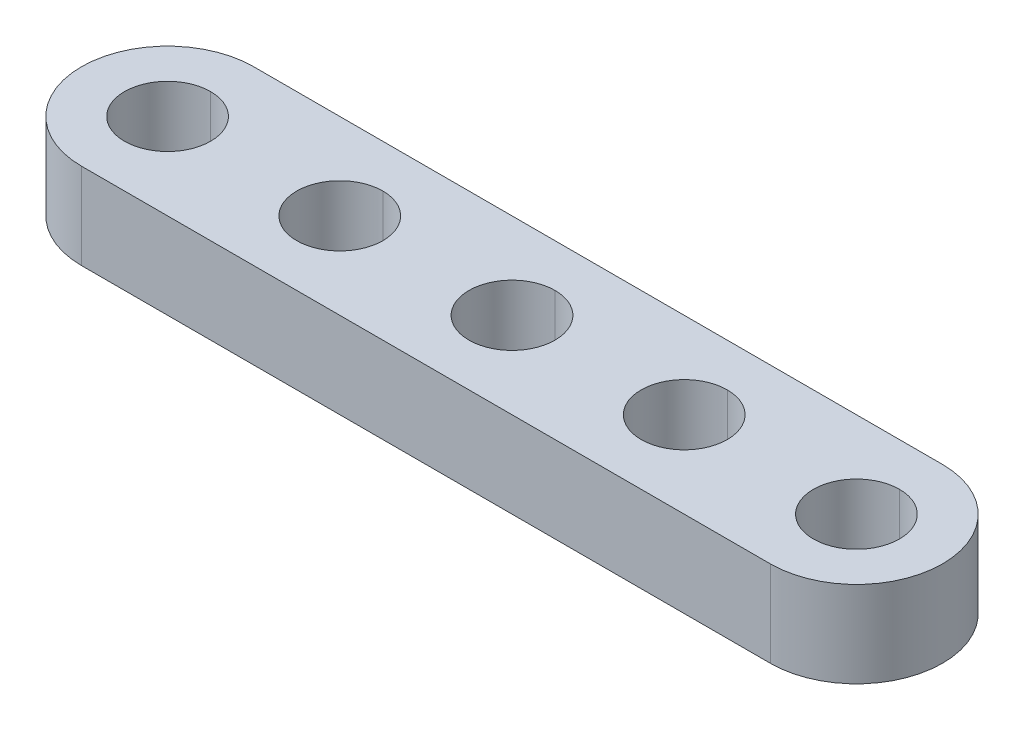
ISO-10303-21;
HEADER;
FILE_DESCRIPTION(('STEP AP214'),'2;1');
FILE_NAME('part.step','',(''),(''),'','','');
FILE_SCHEMA(('AUTOMOTIVE_DESIGN { 1 0 10303 214 1 1 1 1 }'));
ENDSEC;
DATA;
#1=APPLICATION_CONTEXT('core data for automotive mechanical design processes');
#2=APPLICATION_PROTOCOL_DEFINITION('international standard','automotive_design',2000,#1);
#3=PRODUCT_CONTEXT('',#1,'mechanical');
#4=PRODUCT('Part','Part','',(#3));
#5=PRODUCT_RELATED_PRODUCT_CATEGORY('part','',(#4));
#6=PRODUCT_DEFINITION_FORMATION('','',#4);
#7=PRODUCT_DEFINITION_CONTEXT('part definition',#1,'design');
#8=PRODUCT_DEFINITION('design','',#6,#7);
#9=PRODUCT_DEFINITION_SHAPE('','',#8);
#10=(LENGTH_UNIT() NAMED_UNIT(*) SI_UNIT(.MILLI.,.METRE.));
#11=(NAMED_UNIT(*) PLANE_ANGLE_UNIT() SI_UNIT($,.RADIAN.));
#12=(NAMED_UNIT(*) SI_UNIT($,.STERADIAN.) SOLID_ANGLE_UNIT());
#13=UNCERTAINTY_MEASURE_WITH_UNIT(LENGTH_MEASURE(1.E-05),#10,'distance_accuracy_value','');
#14=(GEOMETRIC_REPRESENTATION_CONTEXT(3) GLOBAL_UNCERTAINTY_ASSIGNED_CONTEXT((#13)) GLOBAL_UNIT_ASSIGNED_CONTEXT((#10,
#11,#12)) REPRESENTATION_CONTEXT('',''));
#15=CARTESIAN_POINT('',(0.,0.,0.));
#16=DIRECTION('',(0.,0.,1.));
#17=DIRECTION('',(1.,0.,0.));
#18=AXIS2_PLACEMENT_3D('',#15,#16,#17);
#19=CARTESIAN_POINT('',(16.,4.,0.));
#20=DIRECTION('',(0.,1.,0.));
#21=DIRECTION('',(0.,0.,1.));
#22=AXIS2_PLACEMENT_3D('',#19,#20,#21);
#23=CYLINDRICAL_SURFACE('',#22,2.);
#24=DIRECTION('',(0.,1.,0.));
#25=VECTOR('',#24,1.);
#26=CARTESIAN_POINT('',(16.,4.,-2.));
#27=LINE('',#26,#25);
#28=CARTESIAN_POINT('',(16.,0.,-2.));
#29=VERTEX_POINT('',#28);
#30=CARTESIAN_POINT('',(16.,4.,-2.));
#31=VERTEX_POINT('',#30);
#32=EDGE_CURVE('E167',#29,#31,#27,.T.);
#33=ORIENTED_EDGE('',*,*,#32,.F.);
#34=CARTESIAN_POINT('',(16.,0.,0.));
#35=DIRECTION('',(0.,1.,0.));
#36=DIRECTION('',(0.,0.,1.));
#37=AXIS2_PLACEMENT_3D('',#34,#35,#36);
#38=CIRCLE('',#37,2.);
#39=CARTESIAN_POINT('',(16.,0.,2.));
#40=VERTEX_POINT('',#39);
#41=EDGE_CURVE('E186',#40,#29,#38,.T.);
#42=ORIENTED_EDGE('',*,*,#41,.F.);
#43=DIRECTION('',(0.,1.,0.));
#44=VECTOR('',#43,1.);
#45=CARTESIAN_POINT('',(16.,4.,2.));
#46=LINE('',#45,#44);
#47=CARTESIAN_POINT('',(16.,4.,2.));
#48=VERTEX_POINT('',#47);
#49=EDGE_CURVE('E166',#40,#48,#46,.T.);
#50=ORIENTED_EDGE('',*,*,#49,.T.);
#51=CARTESIAN_POINT('',(16.,4.,0.));
#52=DIRECTION('',(0.,1.,0.));
#53=DIRECTION('',(0.,0.,1.));
#54=AXIS2_PLACEMENT_3D('',#51,#52,#53);
#55=CIRCLE('',#54,2.);
#56=EDGE_CURVE('E135',#48,#31,#55,.T.);
#57=ORIENTED_EDGE('',*,*,#56,.T.);
#58=EDGE_LOOP('',(#33,#42,#50,#57));
#59=FACE_BOUND('',#58,.T.);
#60=ADVANCED_FACE('F15',(#59),#23,.F.);
#61=CARTESIAN_POINT('',(8.,4.,0.));
#62=DIRECTION('',(0.,1.,0.));
#63=DIRECTION('',(0.,0.,1.));
#64=AXIS2_PLACEMENT_3D('',#61,#62,#63);
#65=CYLINDRICAL_SURFACE('',#64,2.);
#66=DIRECTION('',(0.,1.,0.));
#67=VECTOR('',#66,1.);
#68=CARTESIAN_POINT('',(8.,4.,-2.));
#69=LINE('',#68,#67);
#70=CARTESIAN_POINT('',(8.,0.,-2.));
#71=VERTEX_POINT('',#70);
#72=CARTESIAN_POINT('',(8.,4.,-2.));
#73=VERTEX_POINT('',#72);
#74=EDGE_CURVE('E246',#71,#73,#69,.T.);
#75=ORIENTED_EDGE('',*,*,#74,.F.);
#76=CARTESIAN_POINT('',(8.,0.,0.));
#77=DIRECTION('',(0.,1.,0.));
#78=DIRECTION('',(0.,0.,1.));
#79=AXIS2_PLACEMENT_3D('',#76,#77,#78);
#80=CIRCLE('',#79,2.);
#81=CARTESIAN_POINT('',(8.,0.,2.));
#82=VERTEX_POINT('',#81);
#83=EDGE_CURVE('E189',#82,#71,#80,.T.);
#84=ORIENTED_EDGE('',*,*,#83,.F.);
#85=DIRECTION('',(0.,1.,0.));
#86=VECTOR('',#85,1.);
#87=CARTESIAN_POINT('',(8.,4.,2.));
#88=LINE('',#87,#86);
#89=CARTESIAN_POINT('',(8.,4.,2.));
#90=VERTEX_POINT('',#89);
#91=EDGE_CURVE('E191',#82,#90,#88,.T.);
#92=ORIENTED_EDGE('',*,*,#91,.T.);
#93=CARTESIAN_POINT('',(8.,4.,0.));
#94=DIRECTION('',(0.,1.,0.));
#95=DIRECTION('',(0.,0.,1.));
#96=AXIS2_PLACEMENT_3D('',#93,#94,#95);
#97=CIRCLE('',#96,2.);
#98=EDGE_CURVE('E259',#90,#73,#97,.T.);
#99=ORIENTED_EDGE('',*,*,#98,.T.);
#100=EDGE_LOOP('',(#75,#84,#92,#99));
#101=FACE_BOUND('',#100,.T.);
#102=ADVANCED_FACE('F469',(#101),#65,.F.);
#103=CARTESIAN_POINT('',(0.,4.,0.));
#104=DIRECTION('',(0.,1.,0.));
#105=DIRECTION('',(0.,0.,1.));
#106=AXIS2_PLACEMENT_3D('',#103,#104,#105);
#107=CYLINDRICAL_SURFACE('',#106,2.);
#108=DIRECTION('',(0.,1.,0.));
#109=VECTOR('',#108,1.);
#110=CARTESIAN_POINT('',(0.,4.,-2.));
#111=LINE('',#110,#109);
#112=CARTESIAN_POINT('',(0.,0.,-2.));
#113=VERTEX_POINT('',#112);
#114=CARTESIAN_POINT('',(0.,4.,-2.));
#115=VERTEX_POINT('',#114);
#116=EDGE_CURVE('E204',#113,#115,#111,.T.);
#117=ORIENTED_EDGE('',*,*,#116,.F.);
#118=CARTESIAN_POINT('',(0.,0.,0.));
#119=DIRECTION('',(0.,1.,0.));
#120=DIRECTION('',(0.,0.,1.));
#121=AXIS2_PLACEMENT_3D('',#118,#119,#120);
#122=CIRCLE('',#121,2.);
#123=CARTESIAN_POINT('',(0.,0.,2.));
#124=VERTEX_POINT('',#123);
#125=EDGE_CURVE('E236',#124,#113,#122,.T.);
#126=ORIENTED_EDGE('',*,*,#125,.F.);
#127=DIRECTION('',(0.,1.,0.));
#128=VECTOR('',#127,1.);
#129=CARTESIAN_POINT('',(0.,4.,2.));
#130=LINE('',#129,#128);
#131=CARTESIAN_POINT('',(0.,4.,2.));
#132=VERTEX_POINT('',#131);
#133=EDGE_CURVE('E180',#124,#132,#130,.T.);
#134=ORIENTED_EDGE('',*,*,#133,.T.);
#135=CARTESIAN_POINT('',(0.,4.,0.));
#136=DIRECTION('',(0.,1.,0.));
#137=DIRECTION('',(0.,0.,1.));
#138=AXIS2_PLACEMENT_3D('',#135,#136,#137);
#139=CIRCLE('',#138,2.);
#140=EDGE_CURVE('E199',#132,#115,#139,.T.);
#141=ORIENTED_EDGE('',*,*,#140,.T.);
#142=EDGE_LOOP('',(#117,#126,#134,#141));
#143=FACE_BOUND('',#142,.T.);
#144=ADVANCED_FACE('F383',(#143),#107,.F.);
#145=CARTESIAN_POINT('',(-8.,4.,0.));
#146=DIRECTION('',(0.,1.,0.));
#147=DIRECTION('',(0.,0.,1.));
#148=AXIS2_PLACEMENT_3D('',#145,#146,#147);
#149=CYLINDRICAL_SURFACE('',#148,2.);
#150=DIRECTION('',(0.,1.,0.));
#151=VECTOR('',#150,1.);
#152=CARTESIAN_POINT('',(-8.,4.,-2.));
#153=LINE('',#152,#151);
#154=CARTESIAN_POINT('',(-8.,0.,-2.));
#155=VERTEX_POINT('',#154);
#156=CARTESIAN_POINT('',(-8.,4.,-2.));
#157=VERTEX_POINT('',#156);
#158=EDGE_CURVE('E175',#155,#157,#153,.T.);
#159=ORIENTED_EDGE('',*,*,#158,.F.);
#160=CARTESIAN_POINT('',(-8.,0.,0.));
#161=DIRECTION('',(0.,1.,0.));
#162=DIRECTION('',(0.,0.,1.));
#163=AXIS2_PLACEMENT_3D('',#160,#161,#162);
#164=CIRCLE('',#163,2.);
#165=CARTESIAN_POINT('',(-8.,0.,2.));
#166=VERTEX_POINT('',#165);
#167=EDGE_CURVE('E25',#166,#155,#164,.T.);
#168=ORIENTED_EDGE('',*,*,#167,.F.);
#169=DIRECTION('',(0.,1.,0.));
#170=VECTOR('',#169,1.);
#171=CARTESIAN_POINT('',(-8.,4.,2.));
#172=LINE('',#171,#170);
#173=CARTESIAN_POINT('',(-8.,4.,2.));
#174=VERTEX_POINT('',#173);
#175=EDGE_CURVE('E174',#166,#174,#172,.T.);
#176=ORIENTED_EDGE('',*,*,#175,.T.);
#177=CARTESIAN_POINT('',(-8.,4.,0.));
#178=DIRECTION('',(0.,1.,0.));
#179=DIRECTION('',(0.,0.,1.));
#180=AXIS2_PLACEMENT_3D('',#177,#178,#179);
#181=CIRCLE('',#180,2.);
#182=EDGE_CURVE('E197',#174,#157,#181,.T.);
#183=ORIENTED_EDGE('',*,*,#182,.T.);
#184=EDGE_LOOP('',(#159,#168,#176,#183));
#185=FACE_BOUND('',#184,.T.);
#186=ADVANCED_FACE('F375',(#185),#149,.F.);
#187=CARTESIAN_POINT('',(-16.,4.,0.));
#188=DIRECTION('',(0.,1.,0.));
#189=DIRECTION('',(0.,0.,1.));
#190=AXIS2_PLACEMENT_3D('',#187,#188,#189);
#191=CYLINDRICAL_SURFACE('',#190,2.);
#192=DIRECTION('',(0.,1.,0.));
#193=VECTOR('',#192,1.);
#194=CARTESIAN_POINT('',(-16.,4.,-2.));
#195=LINE('',#194,#193);
#196=CARTESIAN_POINT('',(-16.,0.,-2.));
#197=VERTEX_POINT('',#196);
#198=CARTESIAN_POINT('',(-16.,4.,-2.));
#199=VERTEX_POINT('',#198);
#200=EDGE_CURVE('E209',#197,#199,#195,.T.);
#201=ORIENTED_EDGE('',*,*,#200,.F.);
#202=CARTESIAN_POINT('',(-16.,0.,0.));
#203=DIRECTION('',(0.,1.,0.));
#204=DIRECTION('',(0.,0.,1.));
#205=AXIS2_PLACEMENT_3D('',#202,#203,#204);
#206=CIRCLE('',#205,2.);
#207=CARTESIAN_POINT('',(-16.,0.,2.));
#208=VERTEX_POINT('',#207);
#209=EDGE_CURVE('E10',#208,#197,#206,.T.);
#210=ORIENTED_EDGE('',*,*,#209,.F.);
#211=DIRECTION('',(0.,1.,0.));
#212=VECTOR('',#211,1.);
#213=CARTESIAN_POINT('',(-16.,4.,2.));
#214=LINE('',#213,#212);
#215=CARTESIAN_POINT('',(-16.,4.,2.));
#216=VERTEX_POINT('',#215);
#217=EDGE_CURVE('E161',#208,#216,#214,.T.);
#218=ORIENTED_EDGE('',*,*,#217,.T.);
#219=CARTESIAN_POINT('',(-16.,4.,0.));
#220=DIRECTION('',(0.,1.,0.));
#221=DIRECTION('',(0.,0.,1.));
#222=AXIS2_PLACEMENT_3D('',#219,#220,#221);
#223=CIRCLE('',#222,2.);
#224=EDGE_CURVE('E190',#216,#199,#223,.T.);
#225=ORIENTED_EDGE('',*,*,#224,.T.);
#226=EDGE_LOOP('',(#201,#210,#218,#225));
#227=FACE_BOUND('',#226,.T.);
#228=ADVANCED_FACE('F308',(#227),#191,.F.);
#229=CARTESIAN_POINT('',(-16.,0.,0.));
#230=DIRECTION('',(0.,1.,0.));
#231=DIRECTION('',(1.,0.,0.));
#232=AXIS2_PLACEMENT_3D('',#229,#230,#231);
#233=PLANE('',#232);
#234=ORIENTED_EDGE('',*,*,#209,.T.);
#235=CARTESIAN_POINT('',(-16.,0.,0.));
#236=DIRECTION('',(0.,1.,0.));
#237=DIRECTION('',(0.,0.,1.));
#238=AXIS2_PLACEMENT_3D('',#235,#236,#237);
#239=CIRCLE('',#238,2.);
#240=EDGE_CURVE('E213',#197,#208,#239,.T.);
#241=ORIENTED_EDGE('',*,*,#240,.T.);
#242=EDGE_LOOP('',(#234,#241));
#243=FACE_BOUND('',#242,.T.);
#244=ORIENTED_EDGE('',*,*,#167,.T.);
#245=CARTESIAN_POINT('',(-8.,0.,0.));
#246=DIRECTION('',(0.,1.,0.));
#247=DIRECTION('',(0.,0.,1.));
#248=AXIS2_PLACEMENT_3D('',#245,#246,#247);
#249=CIRCLE('',#248,2.);
#250=EDGE_CURVE('E176',#155,#166,#249,.T.);
#251=ORIENTED_EDGE('',*,*,#250,.T.);
#252=EDGE_LOOP('',(#244,#251));
#253=FACE_BOUND('',#252,.T.);
#254=ORIENTED_EDGE('',*,*,#125,.T.);
#255=CARTESIAN_POINT('',(0.,0.,0.));
#256=DIRECTION('',(0.,1.,0.));
#257=DIRECTION('',(0.,0.,1.));
#258=AXIS2_PLACEMENT_3D('',#255,#256,#257);
#259=CIRCLE('',#258,2.);
#260=EDGE_CURVE('E195',#113,#124,#259,.T.);
#261=ORIENTED_EDGE('',*,*,#260,.T.);
#262=EDGE_LOOP('',(#254,#261));
#263=FACE_BOUND('',#262,.T.);
#264=ORIENTED_EDGE('',*,*,#83,.T.);
#265=CARTESIAN_POINT('',(8.,0.,0.));
#266=DIRECTION('',(0.,1.,0.));
#267=DIRECTION('',(0.,0.,1.));
#268=AXIS2_PLACEMENT_3D('',#265,#266,#267);
#269=CIRCLE('',#268,2.);
#270=EDGE_CURVE('E242',#71,#82,#269,.T.);
#271=ORIENTED_EDGE('',*,*,#270,.T.);
#272=EDGE_LOOP('',(#264,#271));
#273=FACE_BOUND('',#272,.T.);
#274=ORIENTED_EDGE('',*,*,#41,.T.);
#275=CARTESIAN_POINT('',(16.,0.,0.));
#276=DIRECTION('',(0.,1.,0.));
#277=DIRECTION('',(0.,0.,1.));
#278=AXIS2_PLACEMENT_3D('',#275,#276,#277);
#279=CIRCLE('',#278,2.);
#280=EDGE_CURVE('E238',#29,#40,#279,.T.);
#281=ORIENTED_EDGE('',*,*,#280,.T.);
#282=EDGE_LOOP('',(#274,#281));
#283=FACE_BOUND('',#282,.T.);
#284=CARTESIAN_POINT('',(-16.,0.,0.));
#285=DIRECTION('',(0.,1.,0.));
#286=DIRECTION('',(0.,0.,1.));
#287=AXIS2_PLACEMENT_3D('',#284,#285,#286);
#288=CIRCLE('',#287,4.);
#289=CARTESIAN_POINT('',(-16.,0.,-4.));
#290=VERTEX_POINT('',#289);
#291=CARTESIAN_POINT('',(-16.,0.,4.));
#292=VERTEX_POINT('',#291);
#293=EDGE_CURVE('E157',#290,#292,#288,.T.);
#294=ORIENTED_EDGE('',*,*,#293,.F.);
#295=DIRECTION('',(-1.,0.,0.));
#296=VECTOR('',#295,1.);
#297=CARTESIAN_POINT('',(-16.,0.,-4.));
#298=LINE('',#297,#296);
#299=CARTESIAN_POINT('',(16.,0.,-4.));
#300=VERTEX_POINT('',#299);
#301=EDGE_CURVE('E136',#300,#290,#298,.T.);
#302=ORIENTED_EDGE('',*,*,#301,.F.);
#303=CARTESIAN_POINT('',(16.,0.,0.));
#304=DIRECTION('',(0.,1.,0.));
#305=DIRECTION('',(0.,0.,1.));
#306=AXIS2_PLACEMENT_3D('',#303,#304,#305);
#307=CIRCLE('',#306,4.);
#308=CARTESIAN_POINT('',(16.,0.,4.));
#309=VERTEX_POINT('',#308);
#310=EDGE_CURVE('E257',#309,#300,#307,.T.);
#311=ORIENTED_EDGE('',*,*,#310,.F.);
#312=DIRECTION('',(1.,0.,0.));
#313=VECTOR('',#312,1.);
#314=CARTESIAN_POINT('',(-16.,0.,4.));
#315=LINE('',#314,#313);
#316=EDGE_CURVE('E18',#292,#309,#315,.T.);
#317=ORIENTED_EDGE('',*,*,#316,.F.);
#318=EDGE_LOOP('',(#294,#302,#311,#317));
#319=FACE_BOUND('',#318,.T.);
#320=ADVANCED_FACE('F374',(#243,#253,#263,#273,#283,#319),#233,.F.);
#321=CARTESIAN_POINT('',(-16.,4.,0.));
#322=DIRECTION('',(0.,1.,0.));
#323=DIRECTION('',(1.,0.,0.));
#324=AXIS2_PLACEMENT_3D('',#321,#322,#323);
#325=PLANE('',#324);
#326=ORIENTED_EDGE('',*,*,#224,.F.);
#327=CARTESIAN_POINT('',(-16.,4.,0.));
#328=DIRECTION('',(0.,1.,0.));
#329=DIRECTION('',(0.,0.,1.));
#330=AXIS2_PLACEMENT_3D('',#327,#328,#329);
#331=CIRCLE('',#330,2.);
#332=EDGE_CURVE('E205',#199,#216,#331,.T.);
#333=ORIENTED_EDGE('',*,*,#332,.F.);
#334=EDGE_LOOP('',(#326,#333));
#335=FACE_BOUND('',#334,.T.);
#336=ORIENTED_EDGE('',*,*,#182,.F.);
#337=CARTESIAN_POINT('',(-8.,4.,0.));
#338=DIRECTION('',(0.,1.,0.));
#339=DIRECTION('',(0.,0.,1.));
#340=AXIS2_PLACEMENT_3D('',#337,#338,#339);
#341=CIRCLE('',#340,2.);
#342=EDGE_CURVE('E170',#157,#174,#341,.T.);
#343=ORIENTED_EDGE('',*,*,#342,.F.);
#344=EDGE_LOOP('',(#336,#343));
#345=FACE_BOUND('',#344,.T.);
#346=ORIENTED_EDGE('',*,*,#140,.F.);
#347=CARTESIAN_POINT('',(0.,4.,0.));
#348=DIRECTION('',(0.,1.,0.));
#349=DIRECTION('',(0.,0.,1.));
#350=AXIS2_PLACEMENT_3D('',#347,#348,#349);
#351=CIRCLE('',#350,2.);
#352=EDGE_CURVE('E212',#115,#132,#351,.T.);
#353=ORIENTED_EDGE('',*,*,#352,.F.);
#354=EDGE_LOOP('',(#346,#353));
#355=FACE_BOUND('',#354,.T.);
#356=ORIENTED_EDGE('',*,*,#98,.F.);
#357=CARTESIAN_POINT('',(8.,4.,0.));
#358=DIRECTION('',(0.,1.,0.));
#359=DIRECTION('',(0.,0.,1.));
#360=AXIS2_PLACEMENT_3D('',#357,#358,#359);
#361=CIRCLE('',#360,2.);
#362=EDGE_CURVE('E196',#73,#90,#361,.T.);
#363=ORIENTED_EDGE('',*,*,#362,.F.);
#364=EDGE_LOOP('',(#356,#363));
#365=FACE_BOUND('',#364,.T.);
#366=ORIENTED_EDGE('',*,*,#56,.F.);
#367=CARTESIAN_POINT('',(16.,4.,0.));
#368=DIRECTION('',(0.,1.,0.));
#369=DIRECTION('',(0.,0.,1.));
#370=AXIS2_PLACEMENT_3D('',#367,#368,#369);
#371=CIRCLE('',#370,2.);
#372=EDGE_CURVE('E163',#31,#48,#371,.T.);
#373=ORIENTED_EDGE('',*,*,#372,.F.);
#374=EDGE_LOOP('',(#366,#373));
#375=FACE_BOUND('',#374,.T.);
#376=CARTESIAN_POINT('',(-16.,4.,0.));
#377=DIRECTION('',(0.,1.,0.));
#378=DIRECTION('',(0.,0.,1.));
#379=AXIS2_PLACEMENT_3D('',#376,#377,#378);
#380=CIRCLE('',#379,4.);
#381=CARTESIAN_POINT('',(-16.,4.,-4.));
#382=VERTEX_POINT('',#381);
#383=CARTESIAN_POINT('',(-16.,4.,4.));
#384=VERTEX_POINT('',#383);
#385=EDGE_CURVE('E130',#382,#384,#380,.T.);
#386=ORIENTED_EDGE('',*,*,#385,.T.);
#387=DIRECTION('',(1.,0.,0.));
#388=VECTOR('',#387,1.);
#389=CARTESIAN_POINT('',(-16.,4.,4.));
#390=LINE('',#389,#388);
#391=CARTESIAN_POINT('',(16.,4.,4.));
#392=VERTEX_POINT('',#391);
#393=EDGE_CURVE('E185',#384,#392,#390,.T.);
#394=ORIENTED_EDGE('',*,*,#393,.T.);
#395=CARTESIAN_POINT('',(16.,4.,0.));
#396=DIRECTION('',(0.,1.,0.));
#397=DIRECTION('',(0.,0.,1.));
#398=AXIS2_PLACEMENT_3D('',#395,#396,#397);
#399=CIRCLE('',#398,4.);
#400=CARTESIAN_POINT('',(16.,4.,-4.));
#401=VERTEX_POINT('',#400);
#402=EDGE_CURVE('E132',#392,#401,#399,.T.);
#403=ORIENTED_EDGE('',*,*,#402,.T.);
#404=DIRECTION('',(-1.,0.,0.));
#405=VECTOR('',#404,1.);
#406=CARTESIAN_POINT('',(-16.,4.,-4.));
#407=LINE('',#406,#405);
#408=EDGE_CURVE('E40',#401,#382,#407,.T.);
#409=ORIENTED_EDGE('',*,*,#408,.T.);
#410=EDGE_LOOP('',(#386,#394,#403,#409));
#411=FACE_BOUND('',#410,.T.);
#412=ADVANCED_FACE('F127',(#335,#345,#355,#365,#375,#411),#325,.T.);
#413=CARTESIAN_POINT('',(-16.,4.,-4.));
#414=DIRECTION('',(0.,0.,1.));
#415=DIRECTION('',(1.,0.,0.));
#416=AXIS2_PLACEMENT_3D('',#413,#414,#415);
#417=PLANE('',#416);
#418=ORIENTED_EDGE('',*,*,#301,.T.);
#419=DIRECTION('',(0.,-1.,0.));
#420=VECTOR('',#419,1.);
#421=CARTESIAN_POINT('',(-16.,4.,-4.));
#422=LINE('',#421,#420);
#423=EDGE_CURVE('E140',#382,#290,#422,.T.);
#424=ORIENTED_EDGE('',*,*,#423,.F.);
#425=ORIENTED_EDGE('',*,*,#408,.F.);
#426=DIRECTION('',(0.,-1.,0.));
#427=VECTOR('',#426,1.);
#428=CARTESIAN_POINT('',(16.,4.,-4.));
#429=LINE('',#428,#427);
#430=EDGE_CURVE('E281',#401,#300,#429,.T.);
#431=ORIENTED_EDGE('',*,*,#430,.T.);
#432=EDGE_LOOP('',(#418,#424,#425,#431));
#433=FACE_BOUND('',#432,.T.);
#434=ADVANCED_FACE('F141',(#433),#417,.F.);
#435=CARTESIAN_POINT('',(16.,4.,0.));
#436=DIRECTION('',(0.,-1.,0.));
#437=DIRECTION('',(0.,0.,-1.));
#438=AXIS2_PLACEMENT_3D('',#435,#436,#437);
#439=CYLINDRICAL_SURFACE('',#438,4.);
#440=ORIENTED_EDGE('',*,*,#310,.T.);
#441=ORIENTED_EDGE('',*,*,#430,.F.);
#442=ORIENTED_EDGE('',*,*,#402,.F.);
#443=DIRECTION('',(0.,-1.,0.));
#444=VECTOR('',#443,1.);
#445=CARTESIAN_POINT('',(16.,4.,4.));
#446=LINE('',#445,#444);
#447=EDGE_CURVE('E181',#392,#309,#446,.T.);
#448=ORIENTED_EDGE('',*,*,#447,.T.);
#449=EDGE_LOOP('',(#440,#441,#442,#448));
#450=FACE_BOUND('',#449,.T.);
#451=ADVANCED_FACE('F388',(#450),#439,.T.);
#452=CARTESIAN_POINT('',(-16.,4.,4.));
#453=DIRECTION('',(0.,0.,-1.));
#454=DIRECTION('',(0.,-1.,0.));
#455=AXIS2_PLACEMENT_3D('',#452,#453,#454);
#456=PLANE('',#455);
#457=ORIENTED_EDGE('',*,*,#316,.T.);
#458=ORIENTED_EDGE('',*,*,#447,.F.);
#459=ORIENTED_EDGE('',*,*,#393,.F.);
#460=DIRECTION('',(0.,-1.,0.));
#461=VECTOR('',#460,1.);
#462=CARTESIAN_POINT('',(-16.,4.,4.));
#463=LINE('',#462,#461);
#464=EDGE_CURVE('E149',#384,#292,#463,.T.);
#465=ORIENTED_EDGE('',*,*,#464,.T.);
#466=EDGE_LOOP('',(#457,#458,#459,#465));
#467=FACE_BOUND('',#466,.T.);
#468=ADVANCED_FACE('F392',(#467),#456,.F.);
#469=CARTESIAN_POINT('',(-16.,4.,0.));
#470=DIRECTION('',(0.,-1.,0.));
#471=DIRECTION('',(0.,0.,-1.));
#472=AXIS2_PLACEMENT_3D('',#469,#470,#471);
#473=CYLINDRICAL_SURFACE('',#472,4.);
#474=ORIENTED_EDGE('',*,*,#293,.T.);
#475=ORIENTED_EDGE('',*,*,#464,.F.);
#476=ORIENTED_EDGE('',*,*,#385,.F.);
#477=ORIENTED_EDGE('',*,*,#423,.T.);
#478=EDGE_LOOP('',(#474,#475,#476,#477));
#479=FACE_BOUND('',#478,.T.);
#480=ADVANCED_FACE('F147',(#479),#473,.T.);
#481=CARTESIAN_POINT('',(-16.,4.,0.));
#482=DIRECTION('',(0.,1.,0.));
#483=DIRECTION('',(0.,0.,1.));
#484=AXIS2_PLACEMENT_3D('',#481,#482,#483);
#485=CYLINDRICAL_SURFACE('',#484,2.);
#486=ORIENTED_EDGE('',*,*,#240,.F.);
#487=ORIENTED_EDGE('',*,*,#200,.T.);
#488=ORIENTED_EDGE('',*,*,#332,.T.);
#489=ORIENTED_EDGE('',*,*,#217,.F.);
#490=EDGE_LOOP('',(#486,#487,#488,#489));
#491=FACE_BOUND('',#490,.T.);
#492=ADVANCED_FACE('F313',(#491),#485,.F.);
#493=CARTESIAN_POINT('',(-8.,4.,0.));
#494=DIRECTION('',(0.,1.,0.));
#495=DIRECTION('',(0.,0.,1.));
#496=AXIS2_PLACEMENT_3D('',#493,#494,#495);
#497=CYLINDRICAL_SURFACE('',#496,2.);
#498=ORIENTED_EDGE('',*,*,#250,.F.);
#499=ORIENTED_EDGE('',*,*,#158,.T.);
#500=ORIENTED_EDGE('',*,*,#342,.T.);
#501=ORIENTED_EDGE('',*,*,#175,.F.);
#502=EDGE_LOOP('',(#498,#499,#500,#501));
#503=FACE_BOUND('',#502,.T.);
#504=ADVANCED_FACE('F446',(#503),#497,.F.);
#505=CARTESIAN_POINT('',(0.,4.,0.));
#506=DIRECTION('',(0.,1.,0.));
#507=DIRECTION('',(0.,0.,1.));
#508=AXIS2_PLACEMENT_3D('',#505,#506,#507);
#509=CYLINDRICAL_SURFACE('',#508,2.);
#510=ORIENTED_EDGE('',*,*,#260,.F.);
#511=ORIENTED_EDGE('',*,*,#116,.T.);
#512=ORIENTED_EDGE('',*,*,#352,.T.);
#513=ORIENTED_EDGE('',*,*,#133,.F.);
#514=EDGE_LOOP('',(#510,#511,#512,#513));
#515=FACE_BOUND('',#514,.T.);
#516=ADVANCED_FACE('F411',(#515),#509,.F.);
#517=CARTESIAN_POINT('',(8.,4.,0.));
#518=DIRECTION('',(0.,1.,0.));
#519=DIRECTION('',(0.,0.,1.));
#520=AXIS2_PLACEMENT_3D('',#517,#518,#519);
#521=CYLINDRICAL_SURFACE('',#520,2.);
#522=ORIENTED_EDGE('',*,*,#270,.F.);
#523=ORIENTED_EDGE('',*,*,#74,.T.);
#524=ORIENTED_EDGE('',*,*,#362,.T.);
#525=ORIENTED_EDGE('',*,*,#91,.F.);
#526=EDGE_LOOP('',(#522,#523,#524,#525));
#527=FACE_BOUND('',#526,.T.);
#528=ADVANCED_FACE('F402',(#527),#521,.F.);
#529=CARTESIAN_POINT('',(16.,4.,0.));
#530=DIRECTION('',(0.,1.,0.));
#531=DIRECTION('',(0.,0.,1.));
#532=AXIS2_PLACEMENT_3D('',#529,#530,#531);
#533=CYLINDRICAL_SURFACE('',#532,2.);
#534=ORIENTED_EDGE('',*,*,#280,.F.);
#535=ORIENTED_EDGE('',*,*,#32,.T.);
#536=ORIENTED_EDGE('',*,*,#372,.T.);
#537=ORIENTED_EDGE('',*,*,#49,.F.);
#538=EDGE_LOOP('',(#534,#535,#536,#537));
#539=FACE_BOUND('',#538,.T.);
#540=ADVANCED_FACE('F398',(#539),#533,.F.);
#541=CLOSED_SHELL('',(#60,#102,#144,#186,#228,#320,#412,#434,#451,#468,#480,#492,#504,#516,#528,#540));
#542=MANIFOLD_SOLID_BREP('B1',#541);
#543=ADVANCED_BREP_SHAPE_REPRESENTATION('',(#18,#542),#14);
#544=SHAPE_DEFINITION_REPRESENTATION(#9,#543);
ENDSEC;
END-ISO-10303-21;
